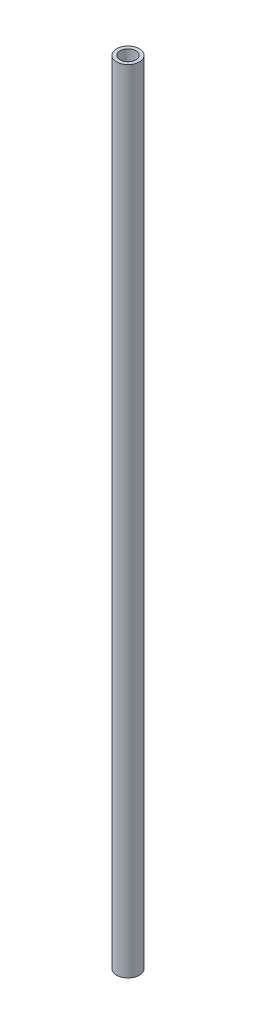
ISO-10303-21;
HEADER;
FILE_DESCRIPTION(('STEP AP214'),'2;1');
FILE_NAME('part.step','',(''),(''),'','','');
FILE_SCHEMA(('AUTOMOTIVE_DESIGN { 1 0 10303 214 1 1 1 1 }'));
ENDSEC;
DATA;
#1=APPLICATION_CONTEXT('core data for automotive mechanical design processes');
#2=APPLICATION_PROTOCOL_DEFINITION('international standard','automotive_design',2000,#1);
#3=PRODUCT_CONTEXT('',#1,'mechanical');
#4=PRODUCT('Part','Part','',(#3));
#5=PRODUCT_RELATED_PRODUCT_CATEGORY('part','',(#4));
#6=PRODUCT_DEFINITION_FORMATION('','',#4);
#7=PRODUCT_DEFINITION_CONTEXT('part definition',#1,'design');
#8=PRODUCT_DEFINITION('design','',#6,#7);
#9=PRODUCT_DEFINITION_SHAPE('','',#8);
#10=(LENGTH_UNIT() NAMED_UNIT(*) SI_UNIT(.MILLI.,.METRE.));
#11=(NAMED_UNIT(*) PLANE_ANGLE_UNIT() SI_UNIT($,.RADIAN.));
#12=(NAMED_UNIT(*) SI_UNIT($,.STERADIAN.) SOLID_ANGLE_UNIT());
#13=UNCERTAINTY_MEASURE_WITH_UNIT(LENGTH_MEASURE(1.E-05),#10,'distance_accuracy_value','');
#14=(GEOMETRIC_REPRESENTATION_CONTEXT(3) GLOBAL_UNCERTAINTY_ASSIGNED_CONTEXT((#13)) GLOBAL_UNIT_ASSIGNED_CONTEXT((#10,
#11,#12)) REPRESENTATION_CONTEXT('',''));
#15=CARTESIAN_POINT('',(0.,0.,0.));
#16=DIRECTION('',(0.,0.,1.));
#17=DIRECTION('',(1.,0.,0.));
#18=AXIS2_PLACEMENT_3D('',#15,#16,#17);
#19=CARTESIAN_POINT('',(0.,260.,0.));
#20=DIRECTION('',(0.,-1.,0.));
#21=DIRECTION('',(0.,0.,-1.));
#22=AXIS2_PLACEMENT_3D('',#19,#20,#21);
#23=CYLINDRICAL_SURFACE('',#22,3.75);
#24=CARTESIAN_POINT('',(0.,260.,0.));
#25=DIRECTION('',(0.,1.,0.));
#26=DIRECTION('',(0.,0.,1.));
#27=AXIS2_PLACEMENT_3D('',#24,#25,#26);
#28=CIRCLE('',#27,3.75);
#29=CARTESIAN_POINT('',(0.,260.,3.75));
#30=VERTEX_POINT('',#29);
#31=EDGE_CURVE('E10',#30,#30,#28,.T.);
#32=ORIENTED_EDGE('',*,*,#31,.F.);
#33=EDGE_LOOP('',(#32));
#34=FACE_BOUND('',#33,.T.);
#35=CARTESIAN_POINT('',(0.,0.,0.));
#36=DIRECTION('',(0.,1.,0.));
#37=DIRECTION('',(0.,0.,1.));
#38=AXIS2_PLACEMENT_3D('',#35,#36,#37);
#39=CIRCLE('',#38,3.75);
#40=CARTESIAN_POINT('',(0.,0.,3.75));
#41=VERTEX_POINT('',#40);
#42=EDGE_CURVE('E40',#41,#41,#39,.T.);
#43=ORIENTED_EDGE('',*,*,#42,.T.);
#44=EDGE_LOOP('',(#43));
#45=FACE_BOUND('',#44,.T.);
#46=ADVANCED_FACE('F37',(#34,#45),#23,.T.);
#47=CARTESIAN_POINT('',(0.,260.,0.));
#48=DIRECTION('',(0.,1.,0.));
#49=DIRECTION('',(0.,0.,1.));
#50=AXIS2_PLACEMENT_3D('',#47,#48,#49);
#51=PLANE('',#50);
#52=CARTESIAN_POINT('',(0.,260.,0.));
#53=DIRECTION('',(0.,1.,0.));
#54=DIRECTION('',(0.,0.,1.));
#55=AXIS2_PLACEMENT_3D('',#52,#53,#54);
#56=CIRCLE('',#55,2.6);
#57=CARTESIAN_POINT('',(0.,260.,2.6));
#58=VERTEX_POINT('',#57);
#59=EDGE_CURVE('E51',#58,#58,#56,.T.);
#60=ORIENTED_EDGE('',*,*,#59,.F.);
#61=EDGE_LOOP('',(#60));
#62=FACE_BOUND('',#61,.T.);
#63=ORIENTED_EDGE('',*,*,#31,.T.);
#64=EDGE_LOOP('',(#63));
#65=FACE_BOUND('',#64,.T.);
#66=ADVANCED_FACE('F68',(#62,#65),#51,.T.);
#67=CARTESIAN_POINT('',(0.,0.,0.));
#68=DIRECTION('',(0.,1.,0.));
#69=DIRECTION('',(0.,0.,1.));
#70=AXIS2_PLACEMENT_3D('',#67,#68,#69);
#71=PLANE('',#70);
#72=CARTESIAN_POINT('',(0.,0.,0.));
#73=DIRECTION('',(0.,1.,0.));
#74=DIRECTION('',(0.,0.,1.));
#75=AXIS2_PLACEMENT_3D('',#72,#73,#74);
#76=CIRCLE('',#75,2.6);
#77=CARTESIAN_POINT('',(0.,0.,2.6));
#78=VERTEX_POINT('',#77);
#79=EDGE_CURVE('E49',#78,#78,#76,.T.);
#80=ORIENTED_EDGE('',*,*,#79,.T.);
#81=EDGE_LOOP('',(#80));
#82=FACE_BOUND('',#81,.T.);
#83=ORIENTED_EDGE('',*,*,#42,.F.);
#84=EDGE_LOOP('',(#83));
#85=FACE_BOUND('',#84,.T.);
#86=ADVANCED_FACE('F59',(#82,#85),#71,.F.);
#87=CARTESIAN_POINT('',(0.,0.,0.));
#88=DIRECTION('',(0.,1.,0.));
#89=DIRECTION('',(0.,0.,1.));
#90=AXIS2_PLACEMENT_3D('',#87,#88,#89);
#91=CYLINDRICAL_SURFACE('',#90,2.6);
#92=ORIENTED_EDGE('',*,*,#79,.F.);
#93=EDGE_LOOP('',(#92));
#94=FACE_BOUND('',#93,.T.);
#95=ORIENTED_EDGE('',*,*,#59,.T.);
#96=EDGE_LOOP('',(#95));
#97=FACE_BOUND('',#96,.T.);
#98=ADVANCED_FACE('F62',(#94,#97),#91,.F.);
#99=CLOSED_SHELL('',(#46,#66,#86,#98));
#100=MANIFOLD_SOLID_BREP('B2',#99);
#101=ADVANCED_BREP_SHAPE_REPRESENTATION('',(#18,#100),#14);
#102=SHAPE_DEFINITION_REPRESENTATION(#9,#101);
ENDSEC;
END-ISO-10303-21;
